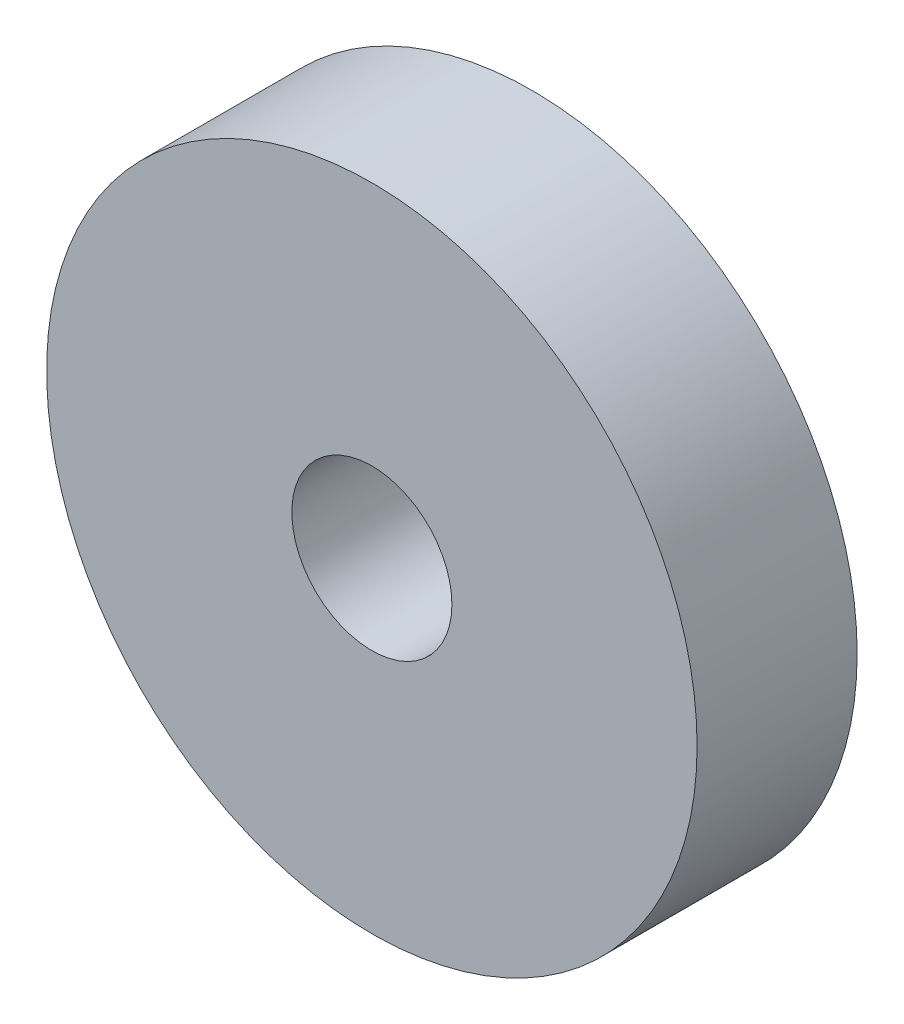
ISO-10303-21;
HEADER;
FILE_DESCRIPTION(('STEP AP214'),'2;1');
FILE_NAME('part.step','',(''),(''),'','','');
FILE_SCHEMA(('AUTOMOTIVE_DESIGN { 1 0 10303 214 1 1 1 1 }'));
ENDSEC;
DATA;
#1=APPLICATION_CONTEXT('core data for automotive mechanical design processes');
#2=APPLICATION_PROTOCOL_DEFINITION('international standard','automotive_design',2000,#1);
#3=PRODUCT_CONTEXT('',#1,'mechanical');
#4=PRODUCT('Part','Part','',(#3));
#5=PRODUCT_RELATED_PRODUCT_CATEGORY('part','',(#4));
#6=PRODUCT_DEFINITION_FORMATION('','',#4);
#7=PRODUCT_DEFINITION_CONTEXT('part definition',#1,'design');
#8=PRODUCT_DEFINITION('design','',#6,#7);
#9=PRODUCT_DEFINITION_SHAPE('','',#8);
#10=(LENGTH_UNIT() NAMED_UNIT(*) SI_UNIT(.MILLI.,.METRE.));
#11=(NAMED_UNIT(*) PLANE_ANGLE_UNIT() SI_UNIT($,.RADIAN.));
#12=(NAMED_UNIT(*) SI_UNIT($,.STERADIAN.) SOLID_ANGLE_UNIT());
#13=UNCERTAINTY_MEASURE_WITH_UNIT(LENGTH_MEASURE(1.E-05),#10,'distance_accuracy_value','');
#14=(GEOMETRIC_REPRESENTATION_CONTEXT(3) GLOBAL_UNCERTAINTY_ASSIGNED_CONTEXT((#13)) GLOBAL_UNIT_ASSIGNED_CONTEXT((#10,
#11,#12)) REPRESENTATION_CONTEXT('',''));
#15=CARTESIAN_POINT('',(0.,0.,0.));
#16=DIRECTION('',(0.,0.,1.));
#17=DIRECTION('',(1.,0.,0.));
#18=AXIS2_PLACEMENT_3D('',#15,#16,#17);
#19=CARTESIAN_POINT('',(0.,0.,3.175));
#20=DIRECTION('',(0.,0.,1.));
#21=DIRECTION('',(1.,0.,0.));
#22=AXIS2_PLACEMENT_3D('',#19,#20,#21);
#23=PLANE('',#22);
#24=CARTESIAN_POINT('',(0.,0.,3.175));
#25=DIRECTION('',(0.,0.,1.));
#26=DIRECTION('',(1.,0.,0.));
#27=AXIS2_PLACEMENT_3D('',#24,#25,#26);
#28=CIRCLE('',#27,6.4516);
#29=CARTESIAN_POINT('',(6.4516,0.,3.175));
#30=VERTEX_POINT('',#29);
#31=EDGE_CURVE('E10',#30,#30,#28,.T.);
#32=ORIENTED_EDGE('',*,*,#31,.T.);
#33=EDGE_LOOP('',(#32));
#34=FACE_BOUND('',#33,.T.);
#35=CARTESIAN_POINT('',(0.,0.,3.175));
#36=DIRECTION('',(0.,0.,1.));
#37=DIRECTION('',(1.,0.,0.));
#38=AXIS2_PLACEMENT_3D('',#35,#36,#37);
#39=CIRCLE('',#38,1.5875);
#40=CARTESIAN_POINT('',(1.5875,0.,3.175));
#41=VERTEX_POINT('',#40);
#42=EDGE_CURVE('E41',#41,#41,#39,.T.);
#43=ORIENTED_EDGE('',*,*,#42,.F.);
#44=EDGE_LOOP('',(#43));
#45=FACE_BOUND('',#44,.T.);
#46=ADVANCED_FACE('F30',(#34,#45),#23,.T.);
#47=CARTESIAN_POINT('',(0.,0.,0.));
#48=DIRECTION('',(0.,0.,1.));
#49=DIRECTION('',(1.,0.,0.));
#50=AXIS2_PLACEMENT_3D('',#47,#48,#49);
#51=PLANE('',#50);
#52=CARTESIAN_POINT('',(0.,0.,0.));
#53=DIRECTION('',(0.,0.,1.));
#54=DIRECTION('',(1.,0.,0.));
#55=AXIS2_PLACEMENT_3D('',#52,#53,#54);
#56=CIRCLE('',#55,6.4516);
#57=CARTESIAN_POINT('',(6.4516,0.,0.));
#58=VERTEX_POINT('',#57);
#59=EDGE_CURVE('E34',#58,#58,#56,.T.);
#60=ORIENTED_EDGE('',*,*,#59,.F.);
#61=EDGE_LOOP('',(#60));
#62=FACE_BOUND('',#61,.T.);
#63=CARTESIAN_POINT('',(0.,0.,0.));
#64=DIRECTION('',(0.,0.,1.));
#65=DIRECTION('',(1.,0.,0.));
#66=AXIS2_PLACEMENT_3D('',#63,#64,#65);
#67=CIRCLE('',#66,1.5875);
#68=CARTESIAN_POINT('',(1.5875,0.,0.));
#69=VERTEX_POINT('',#68);
#70=EDGE_CURVE('E43',#69,#69,#67,.T.);
#71=ORIENTED_EDGE('',*,*,#70,.T.);
#72=EDGE_LOOP('',(#71));
#73=FACE_BOUND('',#72,.T.);
#74=ADVANCED_FACE('F53',(#62,#73),#51,.F.);
#75=CARTESIAN_POINT('',(0.,0.,3.175));
#76=DIRECTION('',(0.,0.,-1.));
#77=DIRECTION('',(-1.,0.,0.));
#78=AXIS2_PLACEMENT_3D('',#75,#76,#77);
#79=CYLINDRICAL_SURFACE('',#78,6.4516);
#80=ORIENTED_EDGE('',*,*,#31,.F.);
#81=EDGE_LOOP('',(#80));
#82=FACE_BOUND('',#81,.T.);
#83=ORIENTED_EDGE('',*,*,#59,.T.);
#84=EDGE_LOOP('',(#83));
#85=FACE_BOUND('',#84,.T.);
#86=ADVANCED_FACE('F32',(#82,#85),#79,.T.);
#87=CARTESIAN_POINT('',(0.,0.,3.175));
#88=DIRECTION('',(0.,0.,-1.));
#89=DIRECTION('',(-1.,0.,0.));
#90=AXIS2_PLACEMENT_3D('',#87,#88,#89);
#91=CYLINDRICAL_SURFACE('',#90,1.5875);
#92=ORIENTED_EDGE('',*,*,#42,.T.);
#93=EDGE_LOOP('',(#92));
#94=FACE_BOUND('',#93,.T.);
#95=ORIENTED_EDGE('',*,*,#70,.F.);
#96=EDGE_LOOP('',(#95));
#97=FACE_BOUND('',#96,.T.);
#98=ADVANCED_FACE('F49',(#94,#97),#91,.F.);
#99=CLOSED_SHELL('',(#46,#74,#86,#98));
#100=MANIFOLD_SOLID_BREP('B2',#99);
#101=ADVANCED_BREP_SHAPE_REPRESENTATION('',(#18,#100),#14);
#102=SHAPE_DEFINITION_REPRESENTATION(#9,#101);
ENDSEC;
END-ISO-10303-21;
